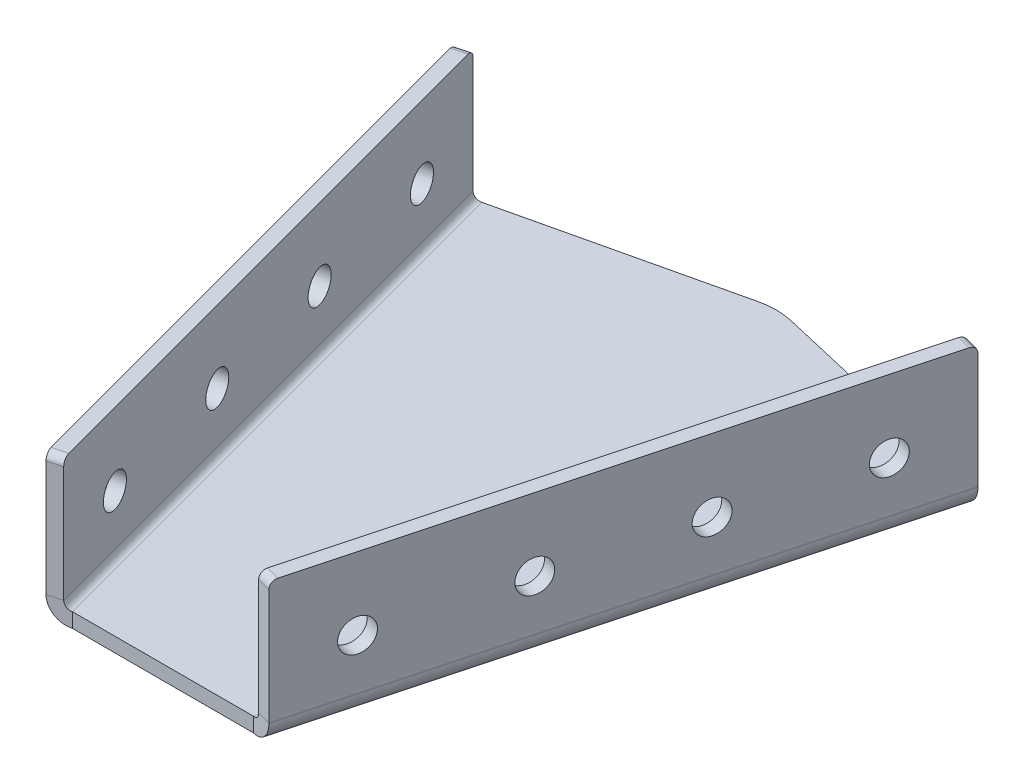
ISO-10303-21;
HEADER;
FILE_DESCRIPTION(('STEP AP214'),'2;1');
FILE_NAME('part.step','',(''),(''),'','','');
FILE_SCHEMA(('AUTOMOTIVE_DESIGN { 1 0 10303 214 1 1 1 1 }'));
ENDSEC;
DATA;
#1=APPLICATION_CONTEXT('core data for automotive mechanical design processes');
#2=APPLICATION_PROTOCOL_DEFINITION('international standard','automotive_design',2000,#1);
#3=PRODUCT_CONTEXT('',#1,'mechanical');
#4=PRODUCT('Part','Part','',(#3));
#5=PRODUCT_RELATED_PRODUCT_CATEGORY('part','',(#4));
#6=PRODUCT_DEFINITION_FORMATION('','',#4);
#7=PRODUCT_DEFINITION_CONTEXT('part definition',#1,'design');
#8=PRODUCT_DEFINITION('design','',#6,#7);
#9=PRODUCT_DEFINITION_SHAPE('','',#8);
#10=(LENGTH_UNIT() NAMED_UNIT(*) SI_UNIT(.MILLI.,.METRE.));
#11=(NAMED_UNIT(*) PLANE_ANGLE_UNIT() SI_UNIT($,.RADIAN.));
#12=(NAMED_UNIT(*) SI_UNIT($,.STERADIAN.) SOLID_ANGLE_UNIT());
#13=UNCERTAINTY_MEASURE_WITH_UNIT(LENGTH_MEASURE(1.E-05),#10,'distance_accuracy_value','');
#14=(GEOMETRIC_REPRESENTATION_CONTEXT(3) GLOBAL_UNCERTAINTY_ASSIGNED_CONTEXT((#13)) GLOBAL_UNIT_ASSIGNED_CONTEXT((#10,
#11,#12)) REPRESENTATION_CONTEXT('',''));
#15=CARTESIAN_POINT('',(0.,0.,0.));
#16=DIRECTION('',(0.,0.,1.));
#17=DIRECTION('',(1.,0.,0.));
#18=AXIS2_PLACEMENT_3D('',#15,#16,#17);
#19=CARTESIAN_POINT('',(-0.641990737657416,-14.410008007584,-86.0435667335885));
#20=DIRECTION('',(0.226616984932633,0.,0.973983953738481));
#21=DIRECTION('',(-0.973983953738481,0.,0.226616984932633));
#22=AXIS2_PLACEMENT_3D('',#19,#20,#21);
#23=PLANE('',#22);
#24=DIRECTION('',(-0.973983953738481,0.,0.226616984932633));
#25=VECTOR('',#24,1.);
#26=CARTESIAN_POINT('',(-0.641990737657416,-14.410008007584,-86.0435667335885));
#27=LINE('',#26,#25);
#28=CARTESIAN_POINT('',(-5.17433043631006,-14.410008007584,-84.9890266117962));
#29=VERTEX_POINT('',#28);
#30=CARTESIAN_POINT('',(-67.0530379540603,-14.410008007584,-70.5916989398396));
#31=VERTEX_POINT('',#30);
#32=EDGE_CURVE('E296',#29,#31,#27,.T.);
#33=ORIENTED_EDGE('',*,*,#32,.F.);
#34=DIRECTION('',(0.,-1.,0.));
#35=VECTOR('',#34,1.);
#36=CARTESIAN_POINT('',(-5.17433043631006,-14.410008007584,-84.9890266117962));
#37=LINE('',#36,#35);
#38=CARTESIAN_POINT('',(-5.17433043631006,-18.410008007584,-84.9890266117962));
#39=VERTEX_POINT('',#38);
#40=EDGE_CURVE('E311',#29,#39,#37,.T.);
#41=ORIENTED_EDGE('',*,*,#40,.T.);
#42=DIRECTION('',(-0.973983953738481,0.,0.226616984932633));
#43=VECTOR('',#42,1.);
#44=CARTESIAN_POINT('',(-0.641990737657416,-18.410008007584,-86.0435667335885));
#45=LINE('',#44,#43);
#46=CARTESIAN_POINT('',(-67.0530379540603,-18.410008007584,-70.5916989398396));
#47=VERTEX_POINT('',#46);
#48=EDGE_CURVE('E294',#39,#47,#45,.T.);
#49=ORIENTED_EDGE('',*,*,#48,.T.);
#50=DIRECTION('',(0.,1.,0.));
#51=VECTOR('',#50,1.);
#52=CARTESIAN_POINT('',(-67.0530379540603,-14.410008007584,-70.5916989398396));
#53=LINE('',#52,#51);
#54=EDGE_CURVE('E304',#47,#31,#53,.T.);
#55=ORIENTED_EDGE('',*,*,#54,.T.);
#56=EDGE_LOOP('',(#33,#41,#49,#55));
#57=FACE_BOUND('',#56,.T.);
#58=ADVANCED_FACE('F16',(#57),#23,.F.);
#59=CARTESIAN_POINT('',(-25.6419907376574,-14.410008007584,83.9564332664115));
#60=DIRECTION('',(0.,0.,-1.));
#61=DIRECTION('',(1.,0.,0.));
#62=AXIS2_PLACEMENT_3D('',#59,#60,#61);
#63=PLANE('',#62);
#64=DIRECTION('',(1.,0.,0.));
#65=VECTOR('',#64,1.);
#66=CARTESIAN_POINT('',(-0.641990737657416,-18.410008007584,83.9564332664115));
#67=LINE('',#66,#65);
#68=CARTESIAN_POINT('',(-25.6419907376574,-18.410008007584,83.9564332664115));
#69=VERTEX_POINT('',#68);
#70=CARTESIAN_POINT('',(24.3580092623425,-18.410008007584,83.9564332664115));
#71=VERTEX_POINT('',#70);
#72=EDGE_CURVE('E301',#69,#71,#67,.T.);
#73=ORIENTED_EDGE('',*,*,#72,.T.);
#74=DIRECTION('',(0.,1.,0.));
#75=VECTOR('',#74,1.);
#76=CARTESIAN_POINT('',(24.3580092623426,-14.410008007584,83.9564332664115));
#77=LINE('',#76,#75);
#78=CARTESIAN_POINT('',(24.3580092623426,-14.410008007584,83.9564332664115));
#79=VERTEX_POINT('',#78);
#80=EDGE_CURVE('E184',#71,#79,#77,.T.);
#81=ORIENTED_EDGE('',*,*,#80,.T.);
#82=DIRECTION('',(1.,0.,0.));
#83=VECTOR('',#82,1.);
#84=CARTESIAN_POINT('',(-25.6419907376574,-14.410008007584,83.9564332664115));
#85=LINE('',#84,#83);
#86=CARTESIAN_POINT('',(-25.6419907376574,-14.410008007584,83.9564332664115));
#87=VERTEX_POINT('',#86);
#88=EDGE_CURVE('E293',#87,#79,#85,.T.);
#89=ORIENTED_EDGE('',*,*,#88,.F.);
#90=DIRECTION('',(0.,1.,0.));
#91=VECTOR('',#90,1.);
#92=CARTESIAN_POINT('',(-25.6419907376574,-14.410008007584,83.9564332664115));
#93=LINE('',#92,#91);
#94=EDGE_CURVE('E298',#69,#87,#93,.T.);
#95=ORIENTED_EDGE('',*,*,#94,.F.);
#96=EDGE_LOOP('',(#73,#81,#89,#95));
#97=FACE_BOUND('',#96,.T.);
#98=ADVANCED_FACE('F367',(#97),#63,.F.);
#99=CARTESIAN_POINT('',(-0.641990737657416,-14.410008007584,83.9564332664115));
#100=DIRECTION('',(0.,-1.,0.));
#101=DIRECTION('',(0.,0.,-1.));
#102=AXIS2_PLACEMENT_3D('',#99,#100,#101);
#103=PLANE('',#102);
#104=ORIENTED_EDGE('',*,*,#88,.T.);
#105=DIRECTION('',(-0.258819045102518,0.,0.965925826289069));
#106=VECTOR('',#105,1.);
#107=CARTESIAN_POINT('',(65.7690564787454,-14.410008007584,-70.5916989398396));
#108=LINE('',#107,#106);
#109=CARTESIAN_POINT('',(65.7690564787454,-14.410008007584,-70.5916989398396));
#110=VERTEX_POINT('',#109);
#111=EDGE_CURVE('E196',#110,#79,#108,.T.);
#112=ORIENTED_EDGE('',*,*,#111,.F.);
#113=DIRECTION('',(0.973983953738481,0.,0.226616984932633));
#114=VECTOR('',#113,1.);
#115=CARTESIAN_POINT('',(-0.641990737657416,-14.410008007584,-86.0435667335885));
#116=LINE('',#115,#114);
#117=CARTESIAN_POINT('',(3.89034896099523,-14.410008007584,-84.9890266117962));
#118=VERTEX_POINT('',#117);
#119=EDGE_CURVE('E199',#118,#110,#116,.T.);
#120=ORIENTED_EDGE('',*,*,#119,.F.);
#121=CARTESIAN_POINT('',(-0.641990737657402,-14.410008007584,-65.5093475370266));
#122=DIRECTION('',(0.,-1.,0.));
#123=DIRECTION('',(0.,0.,-1.));
#124=AXIS2_PLACEMENT_3D('',#121,#122,#123);
#125=CIRCLE('',#124,20.);
#126=EDGE_CURVE('E307',#118,#29,#125,.F.);
#127=ORIENTED_EDGE('',*,*,#126,.T.);
#128=ORIENTED_EDGE('',*,*,#32,.T.);
#129=DIRECTION('',(0.258819045102518,0.,0.965925826289069));
#130=VECTOR('',#129,1.);
#131=CARTESIAN_POINT('',(-67.0530379540603,-14.410008007584,-70.5916989398396));
#132=LINE('',#131,#130);
#133=EDGE_CURVE('E291',#31,#87,#132,.T.);
#134=ORIENTED_EDGE('',*,*,#133,.T.);
#135=EDGE_LOOP('',(#104,#112,#120,#127,#128,#134));
#136=FACE_BOUND('',#135,.T.);
#137=ADVANCED_FACE('F362',(#136),#103,.F.);
#138=CARTESIAN_POINT('',(-0.641990737657416,-18.410008007584,83.9564332664115));
#139=DIRECTION('',(0.,-1.,0.));
#140=DIRECTION('',(0.,0.,-1.));
#141=AXIS2_PLACEMENT_3D('',#138,#139,#140);
#142=PLANE('',#141);
#143=CARTESIAN_POINT('',(-0.641990737657402,-18.410008007584,-65.5093475370266));
#144=DIRECTION('',(0.,-1.,0.));
#145=DIRECTION('',(0.,0.,-1.));
#146=AXIS2_PLACEMENT_3D('',#143,#144,#145);
#147=CIRCLE('',#146,20.);
#148=CARTESIAN_POINT('',(3.89034896099523,-18.410008007584,-84.9890266117962));
#149=VERTEX_POINT('',#148);
#150=EDGE_CURVE('E313',#39,#149,#147,.T.);
#151=ORIENTED_EDGE('',*,*,#150,.T.);
#152=DIRECTION('',(0.973983953738481,0.,0.226616984932633));
#153=VECTOR('',#152,1.);
#154=CARTESIAN_POINT('',(-0.641990737657416,-18.410008007584,-86.0435667335885));
#155=LINE('',#154,#153);
#156=CARTESIAN_POINT('',(65.7690564787454,-18.410008007584,-70.5916989398396));
#157=VERTEX_POINT('',#156);
#158=EDGE_CURVE('E200',#149,#157,#155,.T.);
#159=ORIENTED_EDGE('',*,*,#158,.T.);
#160=DIRECTION('',(-0.258819045102518,0.,0.965925826289069));
#161=VECTOR('',#160,1.);
#162=CARTESIAN_POINT('',(65.7690564787454,-18.410008007584,-70.5916989398396));
#163=LINE('',#162,#161);
#164=EDGE_CURVE('E187',#157,#71,#163,.T.);
#165=ORIENTED_EDGE('',*,*,#164,.T.);
#166=ORIENTED_EDGE('',*,*,#72,.F.);
#167=DIRECTION('',(0.258819045102518,0.,0.965925826289069));
#168=VECTOR('',#167,1.);
#169=CARTESIAN_POINT('',(-67.0530379540603,-18.410008007584,-70.5916989398396));
#170=LINE('',#169,#168);
#171=EDGE_CURVE('E282',#47,#69,#170,.T.);
#172=ORIENTED_EDGE('',*,*,#171,.F.);
#173=ORIENTED_EDGE('',*,*,#48,.F.);
#174=EDGE_LOOP('',(#151,#159,#165,#166,#172,#173));
#175=FACE_BOUND('',#174,.T.);
#176=ADVANCED_FACE('F370',(#175),#142,.T.);
#177=CARTESIAN_POINT('',(-67.0530379540603,-12.410008007584,-70.5916989398396));
#178=DIRECTION('',(-0.258819045102518,0.,-0.965925826289069));
#179=DIRECTION('',(-0.965925826289069,0.,0.258819045102518));
#180=AXIS2_PLACEMENT_3D('',#177,#178,#179);
#181=PLANE('',#180);
#182=DIRECTION('',(0.965925826289069,0.,-0.258819045102518));
#183=VECTOR('',#182,1.);
#184=CARTESIAN_POINT('',(-72.8485929117947,-12.410008007584,-69.0387846692244));
#185=LINE('',#184,#183);
#186=CARTESIAN_POINT('',(-68.9848896066384,-12.410008007584,-70.0740608496346));
#187=VERTEX_POINT('',#186);
#188=CARTESIAN_POINT('',(-72.8485929117947,-12.410008007584,-69.0387846692245));
#189=VERTEX_POINT('',#188);
#190=EDGE_CURVE('E254',#187,#189,#185,.F.);
#191=ORIENTED_EDGE('',*,*,#190,.F.);
#192=CARTESIAN_POINT('',(-67.0530379540603,-12.410008007584,-70.5916989398396));
#193=DIRECTION('',(0.258819045102518,0.,0.965925826289069));
#194=DIRECTION('',(0.965925826289069,0.,-0.258819045102518));
#195=AXIS2_PLACEMENT_3D('',#192,#193,#194);
#196=CIRCLE('',#195,2.00000000000002);
#197=EDGE_CURVE('E286',#31,#187,#196,.F.);
#198=ORIENTED_EDGE('',*,*,#197,.F.);
#199=ORIENTED_EDGE('',*,*,#54,.F.);
#200=CARTESIAN_POINT('',(-67.0530379540603,-12.410008007584,-70.5916989398396));
#201=DIRECTION('',(0.258819045102518,0.,0.965925826289069));
#202=DIRECTION('',(0.965925826289069,0.,-0.258819045102518));
#203=AXIS2_PLACEMENT_3D('',#200,#201,#202);
#204=CIRCLE('',#203,6.00000000000002);
#205=EDGE_CURVE('E279',#47,#189,#204,.F.);
#206=ORIENTED_EDGE('',*,*,#205,.T.);
#207=EDGE_LOOP('',(#191,#198,#199,#206));
#208=FACE_BOUND('',#207,.T.);
#209=ADVANCED_FACE('F351',(#208),#181,.T.);
#210=CARTESIAN_POINT('',(-25.6419907376575,-12.410008007584,83.9564332664115));
#211=DIRECTION('',(-0.258819045102518,0.,-0.965925826289069));
#212=DIRECTION('',(-0.965925826289069,0.,0.258819045102518));
#213=AXIS2_PLACEMENT_3D('',#210,#211,#212);
#214=PLANE('',#213);
#215=CARTESIAN_POINT('',(-25.6419907376575,-12.410008007584,83.9564332664115));
#216=DIRECTION('',(0.258819045102518,0.,0.965925826289069));
#217=DIRECTION('',(0.965925826289069,0.,-0.258819045102518));
#218=AXIS2_PLACEMENT_3D('',#215,#216,#217);
#219=CIRCLE('',#218,2.00000000000002);
#220=CARTESIAN_POINT('',(-27.5738423902356,-12.410008007584,84.4740713566165));
#221=VERTEX_POINT('',#220);
#222=EDGE_CURVE('E257',#221,#87,#219,.T.);
#223=ORIENTED_EDGE('',*,*,#222,.F.);
#224=DIRECTION('',(0.965925826289069,0.,-0.258819045102518));
#225=VECTOR('',#224,1.);
#226=CARTESIAN_POINT('',(-27.5738423902356,-12.410008007584,84.4740713566165));
#227=LINE('',#226,#225);
#228=CARTESIAN_POINT('',(-31.4375456953919,-12.410008007584,85.5093475370266));
#229=VERTEX_POINT('',#228);
#230=EDGE_CURVE('E272',#221,#229,#227,.F.);
#231=ORIENTED_EDGE('',*,*,#230,.T.);
#232=CARTESIAN_POINT('',(-25.6419907376575,-12.410008007584,83.9564332664115));
#233=DIRECTION('',(0.258819045102518,0.,0.965925826289069));
#234=DIRECTION('',(0.965925826289069,0.,-0.258819045102518));
#235=AXIS2_PLACEMENT_3D('',#232,#233,#234);
#236=CIRCLE('',#235,6.00000000000002);
#237=EDGE_CURVE('E283',#229,#69,#236,.T.);
#238=ORIENTED_EDGE('',*,*,#237,.T.);
#239=ORIENTED_EDGE('',*,*,#94,.T.);
#240=EDGE_LOOP('',(#223,#231,#238,#239));
#241=FACE_BOUND('',#240,.T.);
#242=ADVANCED_FACE('F344',(#241),#214,.F.);
#243=CARTESIAN_POINT('',(-25.6419907376574,-12.410008007584,83.9564332664115));
#244=DIRECTION('',(0.258819045102518,0.,0.965925826289069));
#245=DIRECTION('',(-0.965925826289069,0.,0.258819045102518));
#246=AXIS2_PLACEMENT_3D('',#243,#244,#245);
#247=CYLINDRICAL_SURFACE('',#246,6.00000000000002);
#248=ORIENTED_EDGE('',*,*,#171,.T.);
#249=ORIENTED_EDGE('',*,*,#237,.F.);
#250=DIRECTION('',(0.258819045102518,0.,0.965925826289069));
#251=VECTOR('',#250,1.);
#252=CARTESIAN_POINT('',(-72.8485929117947,-12.410008007584,-69.0387846692244));
#253=LINE('',#252,#251);
#254=EDGE_CURVE('E269',#229,#189,#253,.F.);
#255=ORIENTED_EDGE('',*,*,#254,.T.);
#256=ORIENTED_EDGE('',*,*,#205,.F.);
#257=EDGE_LOOP('',(#248,#249,#255,#256));
#258=FACE_BOUND('',#257,.T.);
#259=ADVANCED_FACE('F347',(#258),#247,.T.);
#260=CARTESIAN_POINT('',(-25.6419907376574,-12.410008007584,83.9564332664115));
#261=DIRECTION('',(0.258819045102518,0.,0.965925826289069));
#262=DIRECTION('',(-0.965925826289069,0.,0.258819045102518));
#263=AXIS2_PLACEMENT_3D('',#260,#261,#262);
#264=CYLINDRICAL_SURFACE('',#263,2.00000000000002);
#265=ORIENTED_EDGE('',*,*,#133,.F.);
#266=ORIENTED_EDGE('',*,*,#197,.T.);
#267=DIRECTION('',(0.258819045102518,0.,0.965925826289069));
#268=VECTOR('',#267,1.);
#269=CARTESIAN_POINT('',(-68.9848896066384,-12.410008007584,-70.0740608496345));
#270=LINE('',#269,#268);
#271=EDGE_CURVE('E275',#187,#221,#270,.T.);
#272=ORIENTED_EDGE('',*,*,#271,.T.);
#273=ORIENTED_EDGE('',*,*,#222,.T.);
#274=EDGE_LOOP('',(#265,#266,#272,#273));
#275=FACE_BOUND('',#274,.T.);
#276=ADVANCED_FACE('F359',(#275),#264,.F.);
#277=CARTESIAN_POINT('',(-31.437545695392,21.5899919924127,85.5093475370266));
#278=DIRECTION('',(-0.258819045102518,0.,-0.965925826289069));
#279=DIRECTION('',(-0.965925826289069,0.,0.258819045102518));
#280=AXIS2_PLACEMENT_3D('',#277,#278,#279);
#281=PLANE('',#280);
#282=DIRECTION('',(0.,-1.,0.));
#283=VECTOR('',#282,1.);
#284=CARTESIAN_POINT('',(-27.5738423902357,21.5899919924127,84.4740713566165));
#285=LINE('',#284,#283);
#286=CARTESIAN_POINT('',(-27.5738423902357,19.5899919924127,84.4740713566165));
#287=VERTEX_POINT('',#286);
#288=EDGE_CURVE('E267',#221,#287,#285,.F.);
#289=ORIENTED_EDGE('',*,*,#288,.T.);
#290=DIRECTION('',(0.965925826289069,0.,-0.258819045102518));
#291=VECTOR('',#290,1.);
#292=CARTESIAN_POINT('',(-31.437545695392,19.5899919924127,85.5093475370266));
#293=LINE('',#292,#291);
#294=CARTESIAN_POINT('',(-31.437545695392,19.5899919924127,85.5093475370266));
#295=VERTEX_POINT('',#294);
#296=EDGE_CURVE('E39',#287,#295,#293,.F.);
#297=ORIENTED_EDGE('',*,*,#296,.T.);
#298=DIRECTION('',(0.,1.,0.));
#299=VECTOR('',#298,1.);
#300=CARTESIAN_POINT('',(-31.4375456953918,-18.4100080075841,85.5093475370266));
#301=LINE('',#300,#299);
#302=EDGE_CURVE('E260',#229,#295,#301,.T.);
#303=ORIENTED_EDGE('',*,*,#302,.F.);
#304=ORIENTED_EDGE('',*,*,#230,.F.);
#305=EDGE_LOOP('',(#289,#297,#303,#304));
#306=FACE_BOUND('',#305,.T.);
#307=ADVANCED_FACE('F341',(#306),#281,.F.);
#308=CARTESIAN_POINT('',(-72.8485929117947,-14.410008007584,-69.0387846692244));
#309=DIRECTION('',(0.258819045102518,0.,0.965925826289069));
#310=DIRECTION('',(0.965925826289069,0.,-0.258819045102518));
#311=AXIS2_PLACEMENT_3D('',#308,#309,#310);
#312=PLANE('',#311);
#313=DIRECTION('',(0.,-1.,0.));
#314=VECTOR('',#313,1.);
#315=CARTESIAN_POINT('',(-72.8485929117947,-18.4100080075841,-69.0387846692244));
#316=LINE('',#315,#314);
#317=CARTESIAN_POINT('',(-72.8485929117948,19.5899919924127,-69.0387846692244));
#318=VERTEX_POINT('',#317);
#319=EDGE_CURVE('E255',#318,#189,#316,.T.);
#320=ORIENTED_EDGE('',*,*,#319,.F.);
#321=DIRECTION('',(0.965925826289069,0.,-0.258819045102518));
#322=VECTOR('',#321,1.);
#323=CARTESIAN_POINT('',(-72.8485929117948,19.5899919924127,-69.0387846692244));
#324=LINE('',#323,#322);
#325=CARTESIAN_POINT('',(-68.9848896066385,19.5899919924127,-70.0740608496345));
#326=VERTEX_POINT('',#325);
#327=EDGE_CURVE('E10',#318,#326,#324,.T.);
#328=ORIENTED_EDGE('',*,*,#327,.T.);
#329=DIRECTION('',(0.,1.,0.));
#330=VECTOR('',#329,1.);
#331=CARTESIAN_POINT('',(-68.9848896066384,-14.410008007584,-70.0740608496345));
#332=LINE('',#331,#330);
#333=EDGE_CURVE('E262',#326,#187,#332,.F.);
#334=ORIENTED_EDGE('',*,*,#333,.T.);
#335=ORIENTED_EDGE('',*,*,#190,.T.);
#336=EDGE_LOOP('',(#320,#328,#334,#335));
#337=FACE_BOUND('',#336,.T.);
#338=ADVANCED_FACE('F354',(#337),#312,.F.);
#339=CARTESIAN_POINT('',(-29.7628632426973,-18.4100080075841,91.7593475370265));
#340=DIRECTION('',(0.965925826289069,0.,-0.258819045102518));
#341=DIRECTION('',(-0.258819045102518,0.,-0.965925826289069));
#342=AXIS2_PLACEMENT_3D('',#339,#340,#341);
#343=PLANE('',#342);
#344=CARTESIAN_POINT('',(-57.3194502056437,1.58999199241431,-11.0832350918803));
#345=DIRECTION('',(-0.965925826289069,0.,0.258819045102518));
#346=DIRECTION('',(0.258819045102518,0.,0.965925826289069));
#347=AXIS2_PLACEMENT_3D('',#344,#345,#346);
#348=CIRCLE('',#347,4.50000000000001);
#349=CARTESIAN_POINT('',(-56.1547645026824,1.58999199241431,-6.73656887357947));
#350=VERTEX_POINT('',#349);
#351=EDGE_CURVE('E231',#350,#350,#348,.T.);
#352=ORIENTED_EDGE('',*,*,#351,.F.);
#353=EDGE_LOOP('',(#352));
#354=FACE_BOUND('',#353,.T.);
#355=CARTESIAN_POINT('',(-46.966688401543,1.58999199241435,27.5537979596825));
#356=DIRECTION('',(-0.965925826289069,0.,0.258819045102518));
#357=DIRECTION('',(0.258819045102518,0.,0.965925826289069));
#358=AXIS2_PLACEMENT_3D('',#355,#356,#357);
#359=CIRCLE('',#358,4.49999999999999);
#360=CARTESIAN_POINT('',(-45.8020026985817,1.58999199241435,31.9004641779833));
#361=VERTEX_POINT('',#360);
#362=EDGE_CURVE('E239',#361,#361,#359,.T.);
#363=ORIENTED_EDGE('',*,*,#362,.F.);
#364=EDGE_LOOP('',(#363));
#365=FACE_BOUND('',#364,.T.);
#366=CARTESIAN_POINT('',(-36.6139265974423,1.58999199241439,66.1908310112452));
#367=DIRECTION('',(-0.965925826289069,0.,0.258819045102518));
#368=DIRECTION('',(0.258819045102518,0.,0.965925826289069));
#369=AXIS2_PLACEMENT_3D('',#366,#367,#368);
#370=CIRCLE('',#369,4.5);
#371=CARTESIAN_POINT('',(-35.4492408944809,1.58999199241439,70.537497229546));
#372=VERTEX_POINT('',#371);
#373=EDGE_CURVE('E230',#372,#372,#370,.T.);
#374=ORIENTED_EDGE('',*,*,#373,.F.);
#375=EDGE_LOOP('',(#374));
#376=FACE_BOUND('',#375,.T.);
#377=CARTESIAN_POINT('',(-67.6722120097444,1.58999199241426,-49.720268143443));
#378=DIRECTION('',(-0.965925826289069,0.,0.258819045102518));
#379=DIRECTION('',(0.258819045102518,0.,0.965925826289069));
#380=AXIS2_PLACEMENT_3D('',#377,#378,#379);
#381=CIRCLE('',#380,4.49999999999998);
#382=CARTESIAN_POINT('',(-66.5075263067831,1.58999199241426,-45.3736019251422));
#383=VERTEX_POINT('',#382);
#384=EDGE_CURVE('E238',#383,#383,#381,.T.);
#385=ORIENTED_EDGE('',*,*,#384,.F.);
#386=EDGE_LOOP('',(#385));
#387=FACE_BOUND('',#386,.T.);
#388=ORIENTED_EDGE('',*,*,#302,.T.);
#389=CARTESIAN_POINT('',(-31.955183785597,19.5899919924127,83.5774958844485));
#390=DIRECTION('',(0.965925826289069,0.,-0.258819045102518));
#391=DIRECTION('',(-0.258819045102518,0.,-0.965925826289069));
#392=AXIS2_PLACEMENT_3D('',#389,#390,#391);
#393=CIRCLE('',#392,2.);
#394=CARTESIAN_POINT('',(-31.955183785597,21.5899919924127,83.5774958844485));
#395=VERTEX_POINT('',#394);
#396=EDGE_CURVE('E24',#295,#395,#393,.F.);
#397=ORIENTED_EDGE('',*,*,#396,.T.);
#398=DIRECTION('',(-0.258819045102518,0.,-0.965925826289069));
#399=VECTOR('',#398,1.);
#400=CARTESIAN_POINT('',(-29.7628632426975,21.5899919924127,91.7593475370265));
#401=LINE('',#400,#399);
#402=CARTESIAN_POINT('',(-72.3309548215898,21.5899919924127,-67.1069330166463));
#403=VERTEX_POINT('',#402);
#404=EDGE_CURVE('E258',#395,#403,#401,.T.);
#405=ORIENTED_EDGE('',*,*,#404,.T.);
#406=CARTESIAN_POINT('',(-72.3309548215898,19.5899919924127,-67.1069330166463));
#407=DIRECTION('',(0.965925826289069,0.,-0.258819045102518));
#408=DIRECTION('',(-0.258819045102518,0.,-0.965925826289069));
#409=AXIS2_PLACEMENT_3D('',#406,#407,#408);
#410=CIRCLE('',#409,2.);
#411=EDGE_CURVE('E31',#403,#318,#410,.F.);
#412=ORIENTED_EDGE('',*,*,#411,.T.);
#413=ORIENTED_EDGE('',*,*,#319,.T.);
#414=ORIENTED_EDGE('',*,*,#254,.F.);
#415=EDGE_LOOP('',(#388,#397,#405,#412,#413,#414));
#416=FACE_BOUND('',#415,.T.);
#417=ADVANCED_FACE('F327',(#354,#365,#376,#387,#416),#343,.F.);
#418=CARTESIAN_POINT('',(-25.8991599375411,-18.4100080075841,90.7240713566164));
#419=DIRECTION('',(0.965925826289069,0.,-0.258819045102518));
#420=DIRECTION('',(-0.258819045102518,0.,-0.965925826289069));
#421=AXIS2_PLACEMENT_3D('',#418,#419,#420);
#422=PLANE('',#421);
#423=CARTESIAN_POINT('',(-53.4557469004874,1.58999199241432,-12.1185112722904));
#424=DIRECTION('',(0.965925826289069,0.,-0.258819045102518));
#425=DIRECTION('',(-0.258819045102518,0.,-0.965925826289069));
#426=AXIS2_PLACEMENT_3D('',#423,#424,#425);
#427=CIRCLE('',#426,4.50000000000001);
#428=CARTESIAN_POINT('',(-54.6204326034487,1.58999199241432,-16.4651774905912));
#429=VERTEX_POINT('',#428);
#430=EDGE_CURVE('E234',#429,#429,#427,.F.);
#431=ORIENTED_EDGE('',*,*,#430,.T.);
#432=EDGE_LOOP('',(#431));
#433=FACE_BOUND('',#432,.T.);
#434=CARTESIAN_POINT('',(-43.1029850963867,1.58999199241436,26.5185217792724));
#435=DIRECTION('',(0.965925826289069,0.,-0.258819045102518));
#436=DIRECTION('',(-0.258819045102518,0.,-0.965925826289069));
#437=AXIS2_PLACEMENT_3D('',#434,#435,#436);
#438=CIRCLE('',#437,4.49999999999999);
#439=CARTESIAN_POINT('',(-44.267670799348,1.58999199241436,22.1718555609716));
#440=VERTEX_POINT('',#439);
#441=EDGE_CURVE('E235',#440,#440,#438,.F.);
#442=ORIENTED_EDGE('',*,*,#441,.T.);
#443=EDGE_LOOP('',(#442));
#444=FACE_BOUND('',#443,.T.);
#445=CARTESIAN_POINT('',(-32.750223292286,1.58999199241441,65.1555548308351));
#446=DIRECTION('',(0.965925826289069,0.,-0.258819045102518));
#447=DIRECTION('',(-0.258819045102518,0.,-0.965925826289069));
#448=AXIS2_PLACEMENT_3D('',#445,#446,#447);
#449=CIRCLE('',#448,4.5);
#450=CARTESIAN_POINT('',(-33.9149089952473,1.58999199241441,60.8088886125343));
#451=VERTEX_POINT('',#450);
#452=EDGE_CURVE('E242',#451,#451,#449,.F.);
#453=ORIENTED_EDGE('',*,*,#452,.T.);
#454=EDGE_LOOP('',(#453));
#455=FACE_BOUND('',#454,.T.);
#456=CARTESIAN_POINT('',(-63.8085087045881,1.58999199241427,-50.7555443238531));
#457=DIRECTION('',(0.965925826289069,0.,-0.258819045102518));
#458=DIRECTION('',(-0.258819045102518,0.,-0.965925826289069));
#459=AXIS2_PLACEMENT_3D('',#456,#457,#458);
#460=CIRCLE('',#459,4.49999999999998);
#461=CARTESIAN_POINT('',(-64.9731944075494,1.58999199241427,-55.1022105421539));
#462=VERTEX_POINT('',#461);
#463=EDGE_CURVE('E251',#462,#462,#460,.F.);
#464=ORIENTED_EDGE('',*,*,#463,.T.);
#465=EDGE_LOOP('',(#464));
#466=FACE_BOUND('',#465,.T.);
#467=DIRECTION('',(0.258819045102518,0.,0.965925826289069));
#468=VECTOR('',#467,1.);
#469=CARTESIAN_POINT('',(-68.9848896066385,21.5899919924127,-70.0740608496345));
#470=LINE('',#469,#468);
#471=CARTESIAN_POINT('',(-28.0914804804407,21.5899919924127,82.5422197040385));
#472=VERTEX_POINT('',#471);
#473=CARTESIAN_POINT('',(-68.4672515164335,21.5899919924127,-68.1422091970563));
#474=VERTEX_POINT('',#473);
#475=EDGE_CURVE('E264',#472,#474,#470,.F.);
#476=ORIENTED_EDGE('',*,*,#475,.F.);
#477=CARTESIAN_POINT('',(-28.0914804804407,19.5899919924127,82.5422197040384));
#478=DIRECTION('',(0.965925826289069,0.,-0.258819045102518));
#479=DIRECTION('',(-0.258819045102518,0.,-0.965925826289069));
#480=AXIS2_PLACEMENT_3D('',#477,#478,#479);
#481=CIRCLE('',#480,2.);
#482=EDGE_CURVE('E322',#472,#287,#481,.T.);
#483=ORIENTED_EDGE('',*,*,#482,.T.);
#484=ORIENTED_EDGE('',*,*,#288,.F.);
#485=ORIENTED_EDGE('',*,*,#271,.F.);
#486=ORIENTED_EDGE('',*,*,#333,.F.);
#487=CARTESIAN_POINT('',(-68.4672515164335,19.5899919924127,-68.1422091970563));
#488=DIRECTION('',(0.965925826289069,0.,-0.258819045102518));
#489=DIRECTION('',(-0.258819045102518,0.,-0.965925826289069));
#490=AXIS2_PLACEMENT_3D('',#487,#488,#489);
#491=CIRCLE('',#490,2.);
#492=EDGE_CURVE('E320',#326,#474,#491,.T.);
#493=ORIENTED_EDGE('',*,*,#492,.T.);
#494=EDGE_LOOP('',(#476,#483,#484,#485,#486,#493));
#495=FACE_BOUND('',#494,.T.);
#496=ADVANCED_FACE('F338',(#433,#444,#455,#466,#495),#422,.T.);
#497=CARTESIAN_POINT('',(-72.8485929117948,21.5899919924127,-69.0387846692244));
#498=DIRECTION('',(0.,-1.,0.));
#499=DIRECTION('',(1.,0.,0.));
#500=AXIS2_PLACEMENT_3D('',#497,#498,#499);
#501=PLANE('',#500);
#502=ORIENTED_EDGE('',*,*,#404,.F.);
#503=DIRECTION('',(0.965925826289069,0.,-0.258819045102518));
#504=VECTOR('',#503,1.);
#505=CARTESIAN_POINT('',(-31.955183785597,21.5899919924127,83.5774958844485));
#506=LINE('',#505,#504);
#507=EDGE_CURVE('E317',#395,#472,#506,.T.);
#508=ORIENTED_EDGE('',*,*,#507,.T.);
#509=ORIENTED_EDGE('',*,*,#475,.T.);
#510=DIRECTION('',(0.965925826289069,0.,-0.258819045102518));
#511=VECTOR('',#510,1.);
#512=CARTESIAN_POINT('',(-72.3309548215898,21.5899919924127,-67.1069330166463));
#513=LINE('',#512,#511);
#514=EDGE_CURVE('E315',#474,#403,#513,.F.);
#515=ORIENTED_EDGE('',*,*,#514,.T.);
#516=EDGE_LOOP('',(#502,#508,#509,#515));
#517=FACE_BOUND('',#516,.T.);
#518=ADVANCED_FACE('F332',(#517),#501,.F.);
#519=CARTESIAN_POINT('',(-51.5142800705281,1.58999199241432,-54.049772957913));
#520=DIRECTION('',(-0.965925826289069,0.,0.258819045102518));
#521=DIRECTION('',(0.258819045102518,0.,0.965925826289069));
#522=AXIS2_PLACEMENT_3D('',#519,#520,#521);
#523=CYLINDRICAL_SURFACE('',#522,4.49999999999998);
#524=ORIENTED_EDGE('',*,*,#384,.T.);
#525=EDGE_LOOP('',(#524));
#526=FACE_BOUND('',#525,.T.);
#527=ORIENTED_EDGE('',*,*,#463,.F.);
#528=EDGE_LOOP('',(#527));
#529=FACE_BOUND('',#528,.T.);
#530=ADVANCED_FACE('F490',(#526,#529),#523,.F.);
#531=CARTESIAN_POINT('',(-20.455994658226,1.58999199241445,61.8613261967752));
#532=DIRECTION('',(-0.965925826289069,0.,0.258819045102518));
#533=DIRECTION('',(0.258819045102518,0.,0.965925826289069));
#534=AXIS2_PLACEMENT_3D('',#531,#532,#533);
#535=CYLINDRICAL_SURFACE('',#534,4.5);
#536=ORIENTED_EDGE('',*,*,#373,.T.);
#537=EDGE_LOOP('',(#536));
#538=FACE_BOUND('',#537,.T.);
#539=ORIENTED_EDGE('',*,*,#452,.F.);
#540=EDGE_LOOP('',(#539));
#541=FACE_BOUND('',#540,.T.);
#542=ADVANCED_FACE('F501',(#538,#541),#535,.F.);
#543=CARTESIAN_POINT('',(-30.8087564623267,1.58999199241441,23.2242931452125));
#544=DIRECTION('',(-0.965925826289069,0.,0.258819045102518));
#545=DIRECTION('',(0.258819045102518,0.,0.965925826289069));
#546=AXIS2_PLACEMENT_3D('',#543,#544,#545);
#547=CYLINDRICAL_SURFACE('',#546,4.49999999999999);
#548=ORIENTED_EDGE('',*,*,#362,.T.);
#549=EDGE_LOOP('',(#548));
#550=FACE_BOUND('',#549,.T.);
#551=ORIENTED_EDGE('',*,*,#441,.F.);
#552=EDGE_LOOP('',(#551));
#553=FACE_BOUND('',#552,.T.);
#554=ADVANCED_FACE('F464',(#550,#553),#547,.F.);
#555=CARTESIAN_POINT('',(-41.1615182664274,1.58999199241437,-15.4127399063503));
#556=DIRECTION('',(-0.965925826289069,0.,0.258819045102518));
#557=DIRECTION('',(0.258819045102518,0.,0.965925826289069));
#558=AXIS2_PLACEMENT_3D('',#555,#556,#557);
#559=CYLINDRICAL_SURFACE('',#558,4.50000000000001);
#560=ORIENTED_EDGE('',*,*,#351,.T.);
#561=EDGE_LOOP('',(#560));
#562=FACE_BOUND('',#561,.T.);
#563=ORIENTED_EDGE('',*,*,#430,.F.);
#564=EDGE_LOOP('',(#563));
#565=FACE_BOUND('',#564,.T.);
#566=ADVANCED_FACE('F457',(#562,#565),#559,.F.);
#567=CARTESIAN_POINT('',(-0.641990737657402,-14.410008007584,-65.5093475370266));
#568=DIRECTION('',(0.,1.,0.));
#569=DIRECTION('',(0.,0.,1.));
#570=AXIS2_PLACEMENT_3D('',#567,#568,#569);
#571=CYLINDRICAL_SURFACE('',#570,20.);
#572=ORIENTED_EDGE('',*,*,#126,.F.);
#573=DIRECTION('',(0.,-1.,0.));
#574=VECTOR('',#573,1.);
#575=CARTESIAN_POINT('',(3.89034896099523,-14.410008007584,-84.9890266117962));
#576=LINE('',#575,#574);
#577=EDGE_CURVE('E209',#118,#149,#576,.T.);
#578=ORIENTED_EDGE('',*,*,#577,.T.);
#579=ORIENTED_EDGE('',*,*,#150,.F.);
#580=ORIENTED_EDGE('',*,*,#40,.F.);
#581=EDGE_LOOP('',(#572,#578,#579,#580));
#582=FACE_BOUND('',#581,.T.);
#583=ADVANCED_FACE('F455',(#582),#571,.T.);
#584=CARTESIAN_POINT('',(-31.955183785597,19.5899919924127,83.5774958844485));
#585=DIRECTION('',(0.965925826289069,0.,-0.258819045102518));
#586=DIRECTION('',(-0.258819045102518,0.,-0.965925826289069));
#587=AXIS2_PLACEMENT_3D('',#584,#585,#586);
#588=CYLINDRICAL_SURFACE('',#587,2.);
#589=ORIENTED_EDGE('',*,*,#396,.F.);
#590=ORIENTED_EDGE('',*,*,#296,.F.);
#591=ORIENTED_EDGE('',*,*,#482,.F.);
#592=ORIENTED_EDGE('',*,*,#507,.F.);
#593=EDGE_LOOP('',(#589,#590,#591,#592));
#594=FACE_BOUND('',#593,.T.);
#595=ADVANCED_FACE('F335',(#594),#588,.T.);
#596=CARTESIAN_POINT('',(-72.3309548215897,19.5899919924127,-67.1069330166463));
#597=DIRECTION('',(0.965925826289069,0.,-0.258819045102518));
#598=DIRECTION('',(-0.258819045102518,0.,-0.965925826289069));
#599=AXIS2_PLACEMENT_3D('',#596,#597,#598);
#600=CYLINDRICAL_SURFACE('',#599,2.);
#601=ORIENTED_EDGE('',*,*,#411,.F.);
#602=ORIENTED_EDGE('',*,*,#514,.F.);
#603=ORIENTED_EDGE('',*,*,#492,.F.);
#604=ORIENTED_EDGE('',*,*,#327,.F.);
#605=EDGE_LOOP('',(#601,#602,#603,#604));
#606=FACE_BOUND('',#605,.T.);
#607=ADVANCED_FACE('F18',(#606),#600,.T.);
#608=CARTESIAN_POINT('',(-0.641990737657416,-14.410008007584,-86.0435667335885));
#609=DIRECTION('',(-0.226616984932633,0.,0.973983953738481));
#610=DIRECTION('',(0.973983953738481,0.,0.226616984932633));
#611=AXIS2_PLACEMENT_3D('',#608,#609,#610);
#612=PLANE('',#611);
#613=ORIENTED_EDGE('',*,*,#119,.T.);
#614=DIRECTION('',(0.,1.,0.));
#615=VECTOR('',#614,1.);
#616=CARTESIAN_POINT('',(65.7690564787454,-14.410008007584,-70.5916989398396));
#617=LINE('',#616,#615);
#618=EDGE_CURVE('E206',#157,#110,#617,.T.);
#619=ORIENTED_EDGE('',*,*,#618,.F.);
#620=ORIENTED_EDGE('',*,*,#158,.F.);
#621=ORIENTED_EDGE('',*,*,#577,.F.);
#622=EDGE_LOOP('',(#613,#619,#620,#621));
#623=FACE_BOUND('',#622,.T.);
#624=ADVANCED_FACE('F377',(#623),#612,.F.);
#625=CARTESIAN_POINT('',(65.7690564787454,-12.410008007584,-70.5916989398396));
#626=DIRECTION('',(0.258819045102518,0.,-0.965925826289069));
#627=DIRECTION('',(0.965925826289069,0.,0.258819045102518));
#628=AXIS2_PLACEMENT_3D('',#625,#626,#627);
#629=PLANE('',#628);
#630=DIRECTION('',(-0.965925826289069,0.,-0.258819045102518));
#631=VECTOR('',#630,1.);
#632=CARTESIAN_POINT('',(71.5646114364798,-12.410008007584,-69.0387846692244));
#633=LINE('',#632,#631);
#634=CARTESIAN_POINT('',(67.7009081313236,-12.410008007584,-70.0740608496346));
#635=VERTEX_POINT('',#634);
#636=CARTESIAN_POINT('',(71.5646114364799,-12.410008007584,-69.0387846692245));
#637=VERTEX_POINT('',#636);
#638=EDGE_CURVE('E382',#635,#637,#633,.F.);
#639=ORIENTED_EDGE('',*,*,#638,.T.);
#640=CARTESIAN_POINT('',(65.7690564787454,-12.410008007584,-70.5916989398396));
#641=DIRECTION('',(0.258819045102518,0.,-0.965925826289069));
#642=DIRECTION('',(-0.965925826289069,0.,-0.258819045102518));
#643=AXIS2_PLACEMENT_3D('',#640,#641,#642);
#644=CIRCLE('',#643,6.00000000000002);
#645=EDGE_CURVE('E167',#157,#637,#644,.F.);
#646=ORIENTED_EDGE('',*,*,#645,.F.);
#647=ORIENTED_EDGE('',*,*,#618,.T.);
#648=CARTESIAN_POINT('',(65.7690564787454,-12.410008007584,-70.5916989398396));
#649=DIRECTION('',(0.258819045102518,0.,-0.965925826289069));
#650=DIRECTION('',(-0.965925826289069,0.,-0.258819045102518));
#651=AXIS2_PLACEMENT_3D('',#648,#649,#650);
#652=CIRCLE('',#651,2.00000000000002);
#653=EDGE_CURVE('E185',#110,#635,#652,.F.);
#654=ORIENTED_EDGE('',*,*,#653,.T.);
#655=EDGE_LOOP('',(#639,#646,#647,#654));
#656=FACE_BOUND('',#655,.T.);
#657=ADVANCED_FACE('F380',(#656),#629,.T.);
#658=CARTESIAN_POINT('',(24.3580092623426,-12.410008007584,83.9564332664115));
#659=DIRECTION('',(0.258819045102518,0.,-0.965925826289069));
#660=DIRECTION('',(0.965925826289069,0.,0.258819045102518));
#661=AXIS2_PLACEMENT_3D('',#658,#659,#660);
#662=PLANE('',#661);
#663=CARTESIAN_POINT('',(24.3580092623426,-12.410008007584,83.9564332664115));
#664=DIRECTION('',(0.258819045102518,0.,-0.965925826289069));
#665=DIRECTION('',(-0.965925826289069,0.,-0.258819045102518));
#666=AXIS2_PLACEMENT_3D('',#663,#664,#665);
#667=CIRCLE('',#666,2.00000000000002);
#668=CARTESIAN_POINT('',(26.2898609149208,-12.410008007584,84.4740713566165));
#669=VERTEX_POINT('',#668);
#670=EDGE_CURVE('E190',#669,#79,#667,.T.);
#671=ORIENTED_EDGE('',*,*,#670,.T.);
#672=ORIENTED_EDGE('',*,*,#80,.F.);
#673=CARTESIAN_POINT('',(24.3580092623426,-12.410008007584,83.9564332664115));
#674=DIRECTION('',(0.258819045102518,0.,-0.965925826289069));
#675=DIRECTION('',(-0.965925826289069,0.,-0.258819045102518));
#676=AXIS2_PLACEMENT_3D('',#673,#674,#675);
#677=CIRCLE('',#676,6.00000000000002);
#678=CARTESIAN_POINT('',(30.153564220077,-12.410008007584,85.5093475370266));
#679=VERTEX_POINT('',#678);
#680=EDGE_CURVE('E165',#679,#71,#677,.T.);
#681=ORIENTED_EDGE('',*,*,#680,.F.);
#682=DIRECTION('',(-0.965925826289069,0.,-0.258819045102518));
#683=VECTOR('',#682,1.);
#684=CARTESIAN_POINT('',(26.2898609149207,-12.410008007584,84.4740713566165));
#685=LINE('',#684,#683);
#686=EDGE_CURVE('E170',#669,#679,#685,.F.);
#687=ORIENTED_EDGE('',*,*,#686,.F.);
#688=EDGE_LOOP('',(#671,#672,#681,#687));
#689=FACE_BOUND('',#688,.T.);
#690=ADVANCED_FACE('F182',(#689),#662,.F.);
#691=CARTESIAN_POINT('',(24.3580092623426,-12.410008007584,83.9564332664115));
#692=DIRECTION('',(-0.258819045102518,0.,0.965925826289069));
#693=DIRECTION('',(0.965925826289069,0.,0.258819045102518));
#694=AXIS2_PLACEMENT_3D('',#691,#692,#693);
#695=CYLINDRICAL_SURFACE('',#694,6.00000000000002);
#696=ORIENTED_EDGE('',*,*,#164,.F.);
#697=ORIENTED_EDGE('',*,*,#645,.T.);
#698=DIRECTION('',(-0.258819045102518,0.,0.965925826289069));
#699=VECTOR('',#698,1.);
#700=CARTESIAN_POINT('',(71.5646114364799,-12.410008007584,-69.0387846692244));
#701=LINE('',#700,#699);
#702=EDGE_CURVE('E148',#679,#637,#701,.F.);
#703=ORIENTED_EDGE('',*,*,#702,.F.);
#704=ORIENTED_EDGE('',*,*,#680,.T.);
#705=EDGE_LOOP('',(#696,#697,#703,#704));
#706=FACE_BOUND('',#705,.T.);
#707=ADVANCED_FACE('F163',(#706),#695,.T.);
#708=CARTESIAN_POINT('',(24.3580092623426,-12.410008007584,83.9564332664115));
#709=DIRECTION('',(-0.258819045102518,0.,0.965925826289069));
#710=DIRECTION('',(0.965925826289069,0.,0.258819045102518));
#711=AXIS2_PLACEMENT_3D('',#708,#709,#710);
#712=CYLINDRICAL_SURFACE('',#711,2.00000000000002);
#713=ORIENTED_EDGE('',*,*,#111,.T.);
#714=ORIENTED_EDGE('',*,*,#670,.F.);
#715=DIRECTION('',(-0.258819045102518,0.,0.965925826289069));
#716=VECTOR('',#715,1.);
#717=CARTESIAN_POINT('',(67.7009081313236,-12.410008007584,-70.0740608496345));
#718=LINE('',#717,#716);
#719=EDGE_CURVE('E179',#635,#669,#718,.T.);
#720=ORIENTED_EDGE('',*,*,#719,.F.);
#721=ORIENTED_EDGE('',*,*,#653,.F.);
#722=EDGE_LOOP('',(#713,#714,#720,#721));
#723=FACE_BOUND('',#722,.T.);
#724=ADVANCED_FACE('F451',(#723),#712,.F.);
#725=CARTESIAN_POINT('',(30.1535642200771,21.5899919924127,85.5093475370266));
#726=DIRECTION('',(0.258819045102518,0.,-0.965925826289069));
#727=DIRECTION('',(0.965925826289069,0.,0.258819045102518));
#728=AXIS2_PLACEMENT_3D('',#725,#726,#727);
#729=PLANE('',#728);
#730=DIRECTION('',(0.,-1.,0.));
#731=VECTOR('',#730,1.);
#732=CARTESIAN_POINT('',(26.2898609149209,21.5899919924127,84.4740713566165));
#733=LINE('',#732,#731);
#734=CARTESIAN_POINT('',(26.2898609149208,19.5899919924127,84.4740713566165));
#735=VERTEX_POINT('',#734);
#736=EDGE_CURVE('E169',#669,#735,#733,.F.);
#737=ORIENTED_EDGE('',*,*,#736,.F.);
#738=ORIENTED_EDGE('',*,*,#686,.T.);
#739=DIRECTION('',(0.,1.,0.));
#740=VECTOR('',#739,1.);
#741=CARTESIAN_POINT('',(30.153564220077,-18.4100080075841,85.5093475370266));
#742=LINE('',#741,#740);
#743=CARTESIAN_POINT('',(30.1535642200771,19.5899919924127,85.5093475370266));
#744=VERTEX_POINT('',#743);
#745=EDGE_CURVE('E144',#679,#744,#742,.T.);
#746=ORIENTED_EDGE('',*,*,#745,.T.);
#747=DIRECTION('',(-0.965925826289069,0.,-0.258819045102518));
#748=VECTOR('',#747,1.);
#749=CARTESIAN_POINT('',(30.1535642200771,19.5899919924127,85.5093475370266));
#750=LINE('',#749,#748);
#751=EDGE_CURVE('E222',#735,#744,#750,.F.);
#752=ORIENTED_EDGE('',*,*,#751,.F.);
#753=EDGE_LOOP('',(#737,#738,#746,#752));
#754=FACE_BOUND('',#753,.T.);
#755=ADVANCED_FACE('F173',(#754),#729,.F.);
#756=CARTESIAN_POINT('',(71.5646114364798,-14.410008007584,-69.0387846692244));
#757=DIRECTION('',(-0.258819045102518,0.,0.965925826289069));
#758=DIRECTION('',(-0.965925826289069,0.,-0.258819045102518));
#759=AXIS2_PLACEMENT_3D('',#756,#757,#758);
#760=PLANE('',#759);
#761=DIRECTION('',(0.,-1.,0.));
#762=VECTOR('',#761,1.);
#763=CARTESIAN_POINT('',(71.5646114364799,-18.4100080075841,-69.0387846692244));
#764=LINE('',#763,#762);
#765=CARTESIAN_POINT('',(71.56461143648,19.5899919924127,-69.0387846692244));
#766=VERTEX_POINT('',#765);
#767=EDGE_CURVE('E195',#766,#637,#764,.T.);
#768=ORIENTED_EDGE('',*,*,#767,.T.);
#769=ORIENTED_EDGE('',*,*,#638,.F.);
#770=DIRECTION('',(0.,1.,0.));
#771=VECTOR('',#770,1.);
#772=CARTESIAN_POINT('',(67.7009081313236,-14.410008007584,-70.0740608496345));
#773=LINE('',#772,#771);
#774=CARTESIAN_POINT('',(67.7009081313237,19.5899919924127,-70.0740608496345));
#775=VERTEX_POINT('',#774);
#776=EDGE_CURVE('E158',#775,#635,#773,.F.);
#777=ORIENTED_EDGE('',*,*,#776,.F.);
#778=DIRECTION('',(-0.965925826289069,0.,-0.258819045102518));
#779=VECTOR('',#778,1.);
#780=CARTESIAN_POINT('',(71.56461143648,19.5899919924127,-69.0387846692244));
#781=LINE('',#780,#779);
#782=EDGE_CURVE('E227',#766,#775,#781,.T.);
#783=ORIENTED_EDGE('',*,*,#782,.F.);
#784=EDGE_LOOP('',(#768,#769,#777,#783));
#785=FACE_BOUND('',#784,.T.);
#786=ADVANCED_FACE('F448',(#785),#760,.F.);
#787=CARTESIAN_POINT('',(28.4788817673825,-18.4100080075841,91.7593475370265));
#788=DIRECTION('',(-0.965925826289069,0.,-0.258819045102518));
#789=DIRECTION('',(0.258819045102518,0.,-0.965925826289069));
#790=AXIS2_PLACEMENT_3D('',#787,#788,#789);
#791=PLANE('',#790);
#792=CARTESIAN_POINT('',(56.0354687303289,1.58999199241431,-11.0832350918803));
#793=DIRECTION('',(-0.965925826289069,0.,-0.258819045102518));
#794=DIRECTION('',(-0.258819045102518,0.,0.965925826289069));
#795=AXIS2_PLACEMENT_3D('',#792,#793,#794);
#796=CIRCLE('',#795,4.50000000000001);
#797=CARTESIAN_POINT('',(54.8707830273675,1.58999199241431,-6.73656887357947));
#798=VERTEX_POINT('',#797);
#799=EDGE_CURVE('E412',#798,#798,#796,.T.);
#800=ORIENTED_EDGE('',*,*,#799,.T.);
#801=EDGE_LOOP('',(#800));
#802=FACE_BOUND('',#801,.T.);
#803=CARTESIAN_POINT('',(45.6827069262281,1.58999199241435,27.5537979596825));
#804=DIRECTION('',(-0.965925826289069,0.,-0.258819045102518));
#805=DIRECTION('',(-0.258819045102518,0.,0.965925826289069));
#806=AXIS2_PLACEMENT_3D('',#803,#804,#805);
#807=CIRCLE('',#806,4.49999999999999);
#808=CARTESIAN_POINT('',(44.5180212232668,1.58999199241435,31.9004641779833));
#809=VERTEX_POINT('',#808);
#810=EDGE_CURVE('E405',#809,#809,#807,.T.);
#811=ORIENTED_EDGE('',*,*,#810,.T.);
#812=EDGE_LOOP('',(#811));
#813=FACE_BOUND('',#812,.T.);
#814=CARTESIAN_POINT('',(35.3299451221274,1.58999199241439,66.1908310112452));
#815=DIRECTION('',(-0.965925826289069,0.,-0.258819045102518));
#816=DIRECTION('',(-0.258819045102518,0.,0.965925826289069));
#817=AXIS2_PLACEMENT_3D('',#814,#815,#816);
#818=CIRCLE('',#817,4.5);
#819=CARTESIAN_POINT('',(34.1652594191661,1.58999199241439,70.537497229546));
#820=VERTEX_POINT('',#819);
#821=EDGE_CURVE('E406',#820,#820,#818,.T.);
#822=ORIENTED_EDGE('',*,*,#821,.T.);
#823=EDGE_LOOP('',(#822));
#824=FACE_BOUND('',#823,.T.);
#825=CARTESIAN_POINT('',(66.3882305344296,1.58999199241426,-49.720268143443));
#826=DIRECTION('',(-0.965925826289069,0.,-0.258819045102518));
#827=DIRECTION('',(-0.258819045102518,0.,0.965925826289069));
#828=AXIS2_PLACEMENT_3D('',#825,#826,#827);
#829=CIRCLE('',#828,4.49999999999998);
#830=CARTESIAN_POINT('',(65.2235448314683,1.58999199241426,-45.3736019251422));
#831=VERTEX_POINT('',#830);
#832=EDGE_CURVE('E388',#831,#831,#829,.T.);
#833=ORIENTED_EDGE('',*,*,#832,.T.);
#834=EDGE_LOOP('',(#833));
#835=FACE_BOUND('',#834,.T.);
#836=ORIENTED_EDGE('',*,*,#745,.F.);
#837=ORIENTED_EDGE('',*,*,#702,.T.);
#838=ORIENTED_EDGE('',*,*,#767,.F.);
#839=CARTESIAN_POINT('',(71.0469733462749,19.5899919924127,-67.1069330166463));
#840=DIRECTION('',(0.965925826289069,0.,0.258819045102518));
#841=DIRECTION('',(0.258819045102518,0.,-0.965925826289069));
#842=AXIS2_PLACEMENT_3D('',#839,#840,#841);
#843=CIRCLE('',#842,2.);
#844=CARTESIAN_POINT('',(71.046973346275,21.5899919924127,-67.1069330166463));
#845=VERTEX_POINT('',#844);
#846=EDGE_CURVE('E224',#845,#766,#843,.F.);
#847=ORIENTED_EDGE('',*,*,#846,.F.);
#848=DIRECTION('',(0.258819045102518,0.,-0.965925826289069));
#849=VECTOR('',#848,1.);
#850=CARTESIAN_POINT('',(28.4788817673827,21.5899919924127,91.7593475370265));
#851=LINE('',#850,#849);
#852=CARTESIAN_POINT('',(30.6712023102822,21.5899919924127,83.5774958844485));
#853=VERTEX_POINT('',#852);
#854=EDGE_CURVE('E157',#853,#845,#851,.T.);
#855=ORIENTED_EDGE('',*,*,#854,.F.);
#856=CARTESIAN_POINT('',(30.6712023102822,19.5899919924127,83.5774958844485));
#857=DIRECTION('',(0.965925826289069,0.,0.258819045102518));
#858=DIRECTION('',(0.258819045102518,0.,-0.965925826289069));
#859=AXIS2_PLACEMENT_3D('',#856,#857,#858);
#860=CIRCLE('',#859,2.);
#861=EDGE_CURVE('E152',#744,#853,#860,.F.);
#862=ORIENTED_EDGE('',*,*,#861,.F.);
#863=EDGE_LOOP('',(#836,#837,#838,#847,#855,#862));
#864=FACE_BOUND('',#863,.T.);
#865=ADVANCED_FACE('F146',(#802,#813,#824,#835,#864),#791,.F.);
#866=CARTESIAN_POINT('',(24.6151784622262,-18.4100080075841,90.7240713566164));
#867=DIRECTION('',(-0.965925826289069,0.,-0.258819045102518));
#868=DIRECTION('',(0.258819045102518,0.,-0.965925826289069));
#869=AXIS2_PLACEMENT_3D('',#866,#867,#868);
#870=PLANE('',#869);
#871=CARTESIAN_POINT('',(52.1717654251726,1.58999199241432,-12.1185112722904));
#872=DIRECTION('',(0.965925826289069,0.,0.258819045102518));
#873=DIRECTION('',(0.258819045102518,0.,-0.965925826289069));
#874=AXIS2_PLACEMENT_3D('',#871,#872,#873);
#875=CIRCLE('',#874,4.50000000000001);
#876=CARTESIAN_POINT('',(53.3364511281339,1.58999199241432,-16.4651774905912));
#877=VERTEX_POINT('',#876);
#878=EDGE_CURVE('E401',#877,#877,#875,.F.);
#879=ORIENTED_EDGE('',*,*,#878,.F.);
#880=EDGE_LOOP('',(#879));
#881=FACE_BOUND('',#880,.T.);
#882=CARTESIAN_POINT('',(41.8190036210719,1.58999199241436,26.5185217792724));
#883=DIRECTION('',(0.965925826289069,0.,0.258819045102518));
#884=DIRECTION('',(0.258819045102518,0.,-0.965925826289069));
#885=AXIS2_PLACEMENT_3D('',#882,#883,#884);
#886=CIRCLE('',#885,4.49999999999999);
#887=CARTESIAN_POINT('',(42.9836893240332,1.58999199241436,22.1718555609716));
#888=VERTEX_POINT('',#887);
#889=EDGE_CURVE('E409',#888,#888,#886,.F.);
#890=ORIENTED_EDGE('',*,*,#889,.F.);
#891=EDGE_LOOP('',(#890));
#892=FACE_BOUND('',#891,.T.);
#893=CARTESIAN_POINT('',(31.4662418169711,1.58999199241441,65.1555548308351));
#894=DIRECTION('',(0.965925826289069,0.,0.258819045102518));
#895=DIRECTION('',(0.258819045102518,0.,-0.965925826289069));
#896=AXIS2_PLACEMENT_3D('',#893,#894,#895);
#897=CIRCLE('',#896,4.5);
#898=CARTESIAN_POINT('',(32.6309275199325,1.58999199241441,60.8088886125343));
#899=VERTEX_POINT('',#898);
#900=EDGE_CURVE('E402',#899,#899,#897,.F.);
#901=ORIENTED_EDGE('',*,*,#900,.F.);
#902=EDGE_LOOP('',(#901));
#903=FACE_BOUND('',#902,.T.);
#904=CARTESIAN_POINT('',(62.5245272292733,1.58999199241427,-50.7555443238531));
#905=DIRECTION('',(0.965925826289069,0.,0.258819045102518));
#906=DIRECTION('',(0.258819045102518,0.,-0.965925826289069));
#907=AXIS2_PLACEMENT_3D('',#904,#905,#906);
#908=CIRCLE('',#907,4.49999999999998);
#909=CARTESIAN_POINT('',(63.6892129322346,1.58999199241427,-55.1022105421539));
#910=VERTEX_POINT('',#909);
#911=EDGE_CURVE('E385',#910,#910,#908,.F.);
#912=ORIENTED_EDGE('',*,*,#911,.F.);
#913=EDGE_LOOP('',(#912));
#914=FACE_BOUND('',#913,.T.);
#915=DIRECTION('',(-0.258819045102518,0.,0.965925826289069));
#916=VECTOR('',#915,1.);
#917=CARTESIAN_POINT('',(67.7009081313237,21.5899919924127,-70.0740608496345));
#918=LINE('',#917,#916);
#919=CARTESIAN_POINT('',(26.8074990051259,21.5899919924127,82.5422197040385));
#920=VERTEX_POINT('',#919);
#921=CARTESIAN_POINT('',(67.1832700411186,21.5899919924127,-68.1422091970563));
#922=VERTEX_POINT('',#921);
#923=EDGE_CURVE('E392',#920,#922,#918,.F.);
#924=ORIENTED_EDGE('',*,*,#923,.T.);
#925=CARTESIAN_POINT('',(67.1832700411186,19.5899919924127,-68.1422091970563));
#926=DIRECTION('',(0.965925826289069,0.,0.258819045102518));
#927=DIRECTION('',(0.258819045102518,0.,-0.965925826289069));
#928=AXIS2_PLACEMENT_3D('',#925,#926,#927);
#929=CIRCLE('',#928,2.);
#930=EDGE_CURVE('E217',#775,#922,#929,.T.);
#931=ORIENTED_EDGE('',*,*,#930,.F.);
#932=ORIENTED_EDGE('',*,*,#776,.T.);
#933=ORIENTED_EDGE('',*,*,#719,.T.);
#934=ORIENTED_EDGE('',*,*,#736,.T.);
#935=CARTESIAN_POINT('',(26.8074990051259,19.5899919924127,82.5422197040384));
#936=DIRECTION('',(0.965925826289069,0.,0.258819045102518));
#937=DIRECTION('',(0.258819045102518,0.,-0.965925826289069));
#938=AXIS2_PLACEMENT_3D('',#935,#936,#937);
#939=CIRCLE('',#938,2.);
#940=EDGE_CURVE('E220',#920,#735,#939,.T.);
#941=ORIENTED_EDGE('',*,*,#940,.F.);
#942=EDGE_LOOP('',(#924,#931,#932,#933,#934,#941));
#943=FACE_BOUND('',#942,.T.);
#944=ADVANCED_FACE('F430',(#881,#892,#903,#914,#943),#870,.T.);
#945=CARTESIAN_POINT('',(71.56461143648,21.5899919924127,-69.0387846692244));
#946=DIRECTION('',(0.,-1.,0.));
#947=DIRECTION('',(-1.,0.,0.));
#948=AXIS2_PLACEMENT_3D('',#945,#946,#947);
#949=PLANE('',#948);
#950=ORIENTED_EDGE('',*,*,#854,.T.);
#951=DIRECTION('',(-0.965925826289069,0.,-0.258819045102518));
#952=VECTOR('',#951,1.);
#953=CARTESIAN_POINT('',(71.0469733462749,21.5899919924127,-67.1069330166463));
#954=LINE('',#953,#952);
#955=EDGE_CURVE('E213',#922,#845,#954,.F.);
#956=ORIENTED_EDGE('',*,*,#955,.F.);
#957=ORIENTED_EDGE('',*,*,#923,.F.);
#958=DIRECTION('',(-0.965925826289069,0.,-0.258819045102518));
#959=VECTOR('',#958,1.);
#960=CARTESIAN_POINT('',(30.6712023102821,21.5899919924127,83.5774958844485));
#961=LINE('',#960,#959);
#962=EDGE_CURVE('E215',#853,#920,#961,.T.);
#963=ORIENTED_EDGE('',*,*,#962,.F.);
#964=EDGE_LOOP('',(#950,#956,#957,#963));
#965=FACE_BOUND('',#964,.T.);
#966=ADVANCED_FACE('F433',(#965),#949,.F.);
#967=CARTESIAN_POINT('',(50.2302985952133,1.58999199241432,-54.049772957913));
#968=DIRECTION('',(0.965925826289069,0.,0.258819045102518));
#969=DIRECTION('',(-0.258819045102518,0.,0.965925826289069));
#970=AXIS2_PLACEMENT_3D('',#967,#968,#969);
#971=CYLINDRICAL_SURFACE('',#970,4.49999999999998);
#972=ORIENTED_EDGE('',*,*,#832,.F.);
#973=EDGE_LOOP('',(#972));
#974=FACE_BOUND('',#973,.T.);
#975=ORIENTED_EDGE('',*,*,#911,.T.);
#976=EDGE_LOOP('',(#975));
#977=FACE_BOUND('',#976,.T.);
#978=ADVANCED_FACE('F528',(#974,#977),#971,.F.);
#979=CARTESIAN_POINT('',(19.1720131829111,1.58999199241445,61.8613261967752));
#980=DIRECTION('',(0.965925826289069,0.,0.258819045102518));
#981=DIRECTION('',(-0.258819045102518,0.,0.965925826289069));
#982=AXIS2_PLACEMENT_3D('',#979,#980,#981);
#983=CYLINDRICAL_SURFACE('',#982,4.5);
#984=ORIENTED_EDGE('',*,*,#821,.F.);
#985=EDGE_LOOP('',(#984));
#986=FACE_BOUND('',#985,.T.);
#987=ORIENTED_EDGE('',*,*,#900,.T.);
#988=EDGE_LOOP('',(#987));
#989=FACE_BOUND('',#988,.T.);
#990=ADVANCED_FACE('F535',(#986,#989),#983,.F.);
#991=CARTESIAN_POINT('',(29.5247749870119,1.58999199241441,23.2242931452125));
#992=DIRECTION('',(0.965925826289069,0.,0.258819045102518));
#993=DIRECTION('',(-0.258819045102518,0.,0.965925826289069));
#994=AXIS2_PLACEMENT_3D('',#991,#992,#993);
#995=CYLINDRICAL_SURFACE('',#994,4.49999999999999);
#996=ORIENTED_EDGE('',*,*,#810,.F.);
#997=EDGE_LOOP('',(#996));
#998=FACE_BOUND('',#997,.T.);
#999=ORIENTED_EDGE('',*,*,#889,.T.);
#1000=EDGE_LOOP('',(#999));
#1001=FACE_BOUND('',#1000,.T.);
#1002=ADVANCED_FACE('F426',(#998,#1001),#995,.F.);
#1003=CARTESIAN_POINT('',(39.8775367911126,1.58999199241437,-15.4127399063503));
#1004=DIRECTION('',(0.965925826289069,0.,0.258819045102518));
#1005=DIRECTION('',(-0.258819045102518,0.,0.965925826289069));
#1006=AXIS2_PLACEMENT_3D('',#1003,#1004,#1005);
#1007=CYLINDRICAL_SURFACE('',#1006,4.50000000000001);
#1008=ORIENTED_EDGE('',*,*,#799,.F.);
#1009=EDGE_LOOP('',(#1008));
#1010=FACE_BOUND('',#1009,.T.);
#1011=ORIENTED_EDGE('',*,*,#878,.T.);
#1012=EDGE_LOOP('',(#1011));
#1013=FACE_BOUND('',#1012,.T.);
#1014=ADVANCED_FACE('F422',(#1010,#1013),#1007,.F.);
#1015=CARTESIAN_POINT('',(30.6712023102821,19.5899919924127,83.5774958844485));
#1016=DIRECTION('',(-0.965925826289069,0.,-0.258819045102518));
#1017=DIRECTION('',(0.258819045102518,0.,-0.965925826289069));
#1018=AXIS2_PLACEMENT_3D('',#1015,#1016,#1017);
#1019=CYLINDRICAL_SURFACE('',#1018,2.);
#1020=ORIENTED_EDGE('',*,*,#861,.T.);
#1021=ORIENTED_EDGE('',*,*,#962,.T.);
#1022=ORIENTED_EDGE('',*,*,#940,.T.);
#1023=ORIENTED_EDGE('',*,*,#751,.T.);
#1024=EDGE_LOOP('',(#1020,#1021,#1022,#1023));
#1025=FACE_BOUND('',#1024,.T.);
#1026=ADVANCED_FACE('F425',(#1025),#1019,.T.);
#1027=CARTESIAN_POINT('',(71.0469733462749,19.5899919924127,-67.1069330166463));
#1028=DIRECTION('',(-0.965925826289069,0.,-0.258819045102518));
#1029=DIRECTION('',(0.258819045102518,0.,-0.965925826289069));
#1030=AXIS2_PLACEMENT_3D('',#1027,#1028,#1029);
#1031=CYLINDRICAL_SURFACE('',#1030,2.);
#1032=ORIENTED_EDGE('',*,*,#846,.T.);
#1033=ORIENTED_EDGE('',*,*,#782,.T.);
#1034=ORIENTED_EDGE('',*,*,#930,.T.);
#1035=ORIENTED_EDGE('',*,*,#955,.T.);
#1036=EDGE_LOOP('',(#1032,#1033,#1034,#1035));
#1037=FACE_BOUND('',#1036,.T.);
#1038=ADVANCED_FACE('F446',(#1037),#1031,.T.);
#1039=CLOSED_SHELL('',(#58,#98,#137,#176,#209,#242,#259,#276,#307,#338,#417,#496,#518,#530,#542,
#554,#566,#583,#595,#607,#624,#657,#690,#707,#724,#755,#786,#865,#944,#966,#978,#990,#1002,
#1014,#1026,#1038));
#1040=MANIFOLD_SOLID_BREP('B1',#1039);
#1041=ADVANCED_BREP_SHAPE_REPRESENTATION('',(#18,#1040),#14);
#1042=SHAPE_DEFINITION_REPRESENTATION(#9,#1041);
ENDSEC;
END-ISO-10303-21;
